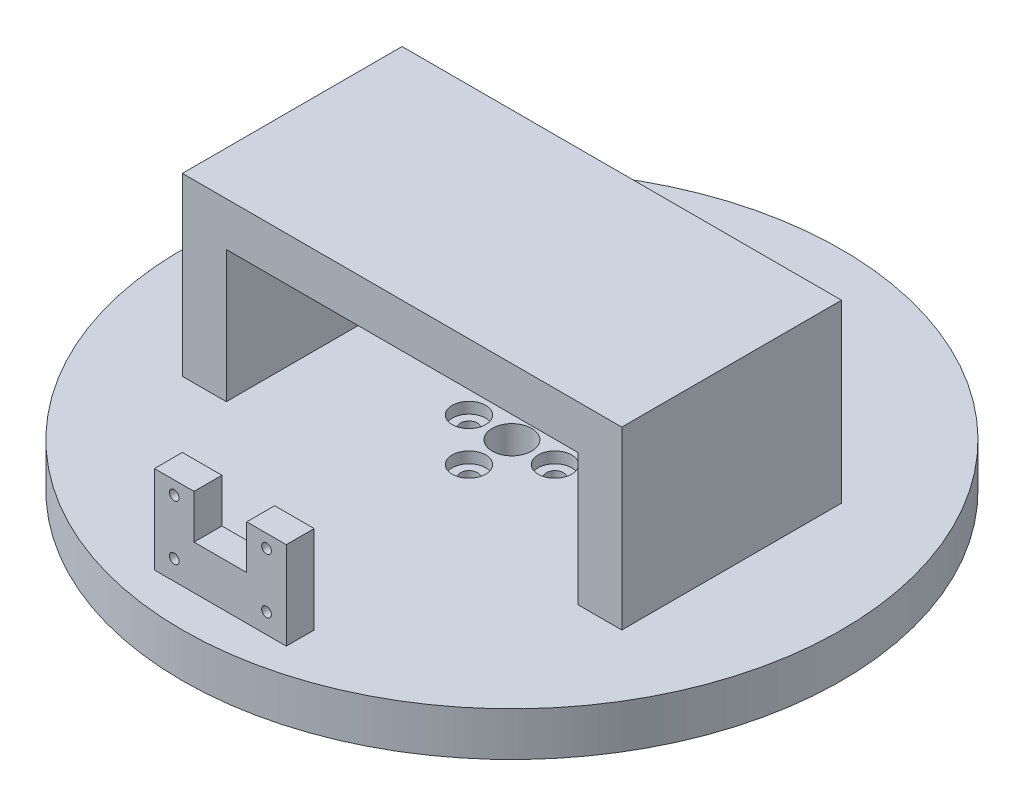
ISO-10303-21;
HEADER;
FILE_DESCRIPTION(('STEP AP214'),'2;1');
FILE_NAME('part.step','',(''),(''),'','','');
FILE_SCHEMA(('AUTOMOTIVE_DESIGN { 1 0 10303 214 1 1 1 1 }'));
ENDSEC;
DATA;
#1=APPLICATION_CONTEXT('core data for automotive mechanical design processes');
#2=APPLICATION_PROTOCOL_DEFINITION('international standard','automotive_design',2000,#1);
#3=PRODUCT_CONTEXT('',#1,'mechanical');
#4=PRODUCT('Part','Part','',(#3));
#5=PRODUCT_RELATED_PRODUCT_CATEGORY('part','',(#4));
#6=PRODUCT_DEFINITION_FORMATION('','',#4);
#7=PRODUCT_DEFINITION_CONTEXT('part definition',#1,'design');
#8=PRODUCT_DEFINITION('design','',#6,#7);
#9=PRODUCT_DEFINITION_SHAPE('','',#8);
#10=(LENGTH_UNIT() NAMED_UNIT(*) SI_UNIT(.MILLI.,.METRE.));
#11=(NAMED_UNIT(*) PLANE_ANGLE_UNIT() SI_UNIT($,.RADIAN.));
#12=(NAMED_UNIT(*) SI_UNIT($,.STERADIAN.) SOLID_ANGLE_UNIT());
#13=UNCERTAINTY_MEASURE_WITH_UNIT(LENGTH_MEASURE(1.E-05),#10,'distance_accuracy_value','');
#14=(GEOMETRIC_REPRESENTATION_CONTEXT(3) GLOBAL_UNCERTAINTY_ASSIGNED_CONTEXT((#13)) GLOBAL_UNIT_ASSIGNED_CONTEXT((#10,
#11,#12)) REPRESENTATION_CONTEXT('',''));
#15=CARTESIAN_POINT('',(0.,0.,0.));
#16=DIRECTION('',(0.,0.,1.));
#17=DIRECTION('',(1.,0.,0.));
#18=AXIS2_PLACEMENT_3D('',#15,#16,#17);
#19=CARTESIAN_POINT('',(0.,30.,0.));
#20=DIRECTION('',(0.,1.,0.));
#21=DIRECTION('',(0.,0.,1.));
#22=AXIS2_PLACEMENT_3D('',#19,#20,#21);
#23=PLANE('',#22);
#24=DIRECTION('',(0.,0.,-1.));
#25=VECTOR('',#24,1.);
#26=CARTESIAN_POINT('',(-6.,30.,-75.001));
#27=LINE('',#26,#25);
#28=CARTESIAN_POINT('',(-6.,30.,66.35));
#29=VERTEX_POINT('',#28);
#30=CARTESIAN_POINT('',(-6.,30.,60.));
#31=VERTEX_POINT('',#30);
#32=EDGE_CURVE('E164',#29,#31,#27,.T.);
#33=ORIENTED_EDGE('',*,*,#32,.T.);
#34=DIRECTION('',(-1.,0.,0.));
#35=VECTOR('',#34,1.);
#36=CARTESIAN_POINT('',(15.,30.,60.));
#37=LINE('',#36,#35);
#38=CARTESIAN_POINT('',(-15.,30.,60.));
#39=VERTEX_POINT('',#38);
#40=EDGE_CURVE('E182',#31,#39,#37,.T.);
#41=ORIENTED_EDGE('',*,*,#40,.T.);
#42=DIRECTION('',(0.,0.,1.));
#43=VECTOR('',#42,1.);
#44=CARTESIAN_POINT('',(-15.,30.,66.35));
#45=LINE('',#44,#43);
#46=CARTESIAN_POINT('',(-15.,30.,66.35));
#47=VERTEX_POINT('',#46);
#48=EDGE_CURVE('E204',#39,#47,#45,.T.);
#49=ORIENTED_EDGE('',*,*,#48,.T.);
#50=DIRECTION('',(1.,0.,0.));
#51=VECTOR('',#50,1.);
#52=CARTESIAN_POINT('',(15.,30.,66.35));
#53=LINE('',#52,#51);
#54=EDGE_CURVE('E537',#47,#29,#53,.T.);
#55=ORIENTED_EDGE('',*,*,#54,.T.);
#56=EDGE_LOOP('',(#33,#41,#49,#55));
#57=FACE_BOUND('',#56,.T.);
#58=ADVANCED_FACE('F41',(#57),#23,.T.);
#59=CARTESIAN_POINT('',(0.,10.,0.));
#60=DIRECTION('',(0.,1.,0.));
#61=DIRECTION('',(0.,0.,1.));
#62=AXIS2_PLACEMENT_3D('',#59,#60,#61);
#63=PLANE('',#62);
#64=DIRECTION('',(0.,0.,1.));
#65=VECTOR('',#64,1.);
#66=CARTESIAN_POINT('',(50.,10.,25.));
#67=LINE('',#66,#65);
#68=CARTESIAN_POINT('',(50.,10.,-25.));
#69=VERTEX_POINT('',#68);
#70=CARTESIAN_POINT('',(50.,10.,25.));
#71=VERTEX_POINT('',#70);
#72=EDGE_CURVE('E219',#69,#71,#67,.T.);
#73=ORIENTED_EDGE('',*,*,#72,.T.);
#74=DIRECTION('',(-1.,0.,0.));
#75=VECTOR('',#74,1.);
#76=CARTESIAN_POINT('',(40.,10.,25.));
#77=LINE('',#76,#75);
#78=CARTESIAN_POINT('',(40.,10.,25.));
#79=VERTEX_POINT('',#78);
#80=EDGE_CURVE('E225',#71,#79,#77,.T.);
#81=ORIENTED_EDGE('',*,*,#80,.T.);
#82=DIRECTION('',(0.,0.,-1.));
#83=VECTOR('',#82,1.);
#84=CARTESIAN_POINT('',(40.,10.,25.));
#85=LINE('',#84,#83);
#86=CARTESIAN_POINT('',(40.,10.,-25.));
#87=VERTEX_POINT('',#86);
#88=EDGE_CURVE('E231',#79,#87,#85,.T.);
#89=ORIENTED_EDGE('',*,*,#88,.T.);
#90=DIRECTION('',(1.,0.,0.));
#91=VECTOR('',#90,1.);
#92=CARTESIAN_POINT('',(40.,10.,-25.));
#93=LINE('',#92,#91);
#94=EDGE_CURVE('E228',#87,#69,#93,.T.);
#95=ORIENTED_EDGE('',*,*,#94,.T.);
#96=EDGE_LOOP('',(#73,#81,#89,#95));
#97=FACE_BOUND('',#96,.T.);
#98=CARTESIAN_POINT('',(9.779,10.,0.));
#99=DIRECTION('',(0.,1.,0.));
#100=DIRECTION('',(-1.,0.,0.));
#101=AXIS2_PLACEMENT_3D('',#98,#99,#100);
#102=CIRCLE('',#101,3.81);
#103=CARTESIAN_POINT('',(5.969,10.,0.));
#104=VERTEX_POINT('',#103);
#105=EDGE_CURVE('E305',#104,#104,#102,.T.);
#106=ORIENTED_EDGE('',*,*,#105,.F.);
#107=EDGE_LOOP('',(#106));
#108=FACE_BOUND('',#107,.T.);
#109=CARTESIAN_POINT('',(0.,10.,9.779));
#110=DIRECTION('',(0.,1.,0.));
#111=DIRECTION('',(0.,0.,-1.));
#112=AXIS2_PLACEMENT_3D('',#109,#110,#111);
#113=CIRCLE('',#112,3.81);
#114=CARTESIAN_POINT('',(0.,10.,5.969));
#115=VERTEX_POINT('',#114);
#116=EDGE_CURVE('E313',#115,#115,#113,.T.);
#117=ORIENTED_EDGE('',*,*,#116,.F.);
#118=EDGE_LOOP('',(#117));
#119=FACE_BOUND('',#118,.T.);
#120=CARTESIAN_POINT('',(-9.779,10.,-1.02429588037641E-13));
#121=DIRECTION('',(0.,1.,0.));
#122=DIRECTION('',(1.,0.,0.));
#123=AXIS2_PLACEMENT_3D('',#120,#121,#122);
#124=CIRCLE('',#123,3.81);
#125=CARTESIAN_POINT('',(-5.969,10.,0.));
#126=VERTEX_POINT('',#125);
#127=EDGE_CURVE('E299',#126,#126,#124,.T.);
#128=ORIENTED_EDGE('',*,*,#127,.F.);
#129=EDGE_LOOP('',(#128));
#130=FACE_BOUND('',#129,.T.);
#131=CARTESIAN_POINT('',(0.,10.,-9.779));
#132=DIRECTION('',(0.,1.,0.));
#133=DIRECTION('',(0.,0.,1.));
#134=AXIS2_PLACEMENT_3D('',#131,#132,#133);
#135=CIRCLE('',#134,3.81);
#136=CARTESIAN_POINT('',(0.,10.,-5.969));
#137=VERTEX_POINT('',#136);
#138=EDGE_CURVE('E329',#137,#137,#135,.T.);
#139=ORIENTED_EDGE('',*,*,#138,.F.);
#140=EDGE_LOOP('',(#139));
#141=FACE_BOUND('',#140,.T.);
#142=CARTESIAN_POINT('',(0.,10.,0.));
#143=DIRECTION('',(0.,1.,0.));
#144=DIRECTION('',(0.,0.,1.));
#145=AXIS2_PLACEMENT_3D('',#142,#143,#144);
#146=CIRCLE('',#145,4.5);
#147=CARTESIAN_POINT('',(0.,10.,4.5));
#148=VERTEX_POINT('',#147);
#149=EDGE_CURVE('E338',#148,#148,#146,.T.);
#150=ORIENTED_EDGE('',*,*,#149,.F.);
#151=EDGE_LOOP('',(#150));
#152=FACE_BOUND('',#151,.T.);
#153=CARTESIAN_POINT('',(0.,10.,0.));
#154=DIRECTION('',(0.,1.,0.));
#155=DIRECTION('',(0.,0.,1.));
#156=AXIS2_PLACEMENT_3D('',#153,#154,#155);
#157=CIRCLE('',#156,75.);
#158=CARTESIAN_POINT('',(0.,10.,75.));
#159=VERTEX_POINT('',#158);
#160=EDGE_CURVE('E11',#159,#159,#157,.T.);
#161=ORIENTED_EDGE('',*,*,#160,.T.);
#162=EDGE_LOOP('',(#161));
#163=FACE_BOUND('',#162,.T.);
#164=DIRECTION('',(1.,0.,0.));
#165=VECTOR('',#164,1.);
#166=CARTESIAN_POINT('',(-40.,10.,25.));
#167=LINE('',#166,#165);
#168=CARTESIAN_POINT('',(-50.,10.,25.));
#169=VERTEX_POINT('',#168);
#170=CARTESIAN_POINT('',(-40.,10.,25.));
#171=VERTEX_POINT('',#170);
#172=EDGE_CURVE('E277',#169,#171,#167,.T.);
#173=ORIENTED_EDGE('',*,*,#172,.F.);
#174=DIRECTION('',(0.,0.,1.));
#175=VECTOR('',#174,1.);
#176=CARTESIAN_POINT('',(-50.,10.,25.));
#177=LINE('',#176,#175);
#178=CARTESIAN_POINT('',(-50.,10.,-25.));
#179=VERTEX_POINT('',#178);
#180=EDGE_CURVE('E261',#179,#169,#177,.T.);
#181=ORIENTED_EDGE('',*,*,#180,.F.);
#182=DIRECTION('',(-1.,0.,0.));
#183=VECTOR('',#182,1.);
#184=CARTESIAN_POINT('',(-40.,10.,-25.));
#185=LINE('',#184,#183);
#186=CARTESIAN_POINT('',(-40.,10.,-25.));
#187=VERTEX_POINT('',#186);
#188=EDGE_CURVE('E267',#187,#179,#185,.T.);
#189=ORIENTED_EDGE('',*,*,#188,.F.);
#190=DIRECTION('',(0.,0.,-1.));
#191=VECTOR('',#190,1.);
#192=CARTESIAN_POINT('',(-40.,10.,25.));
#193=LINE('',#192,#191);
#194=EDGE_CURVE('E281',#171,#187,#193,.T.);
#195=ORIENTED_EDGE('',*,*,#194,.F.);
#196=EDGE_LOOP('',(#173,#181,#189,#195));
#197=FACE_BOUND('',#196,.T.);
#198=DIRECTION('',(1.,0.,0.));
#199=VECTOR('',#198,1.);
#200=CARTESIAN_POINT('',(15.,10.,66.35));
#201=LINE('',#200,#199);
#202=CARTESIAN_POINT('',(-15.,10.,66.35));
#203=VERTEX_POINT('',#202);
#204=CARTESIAN_POINT('',(15.,10.,66.35));
#205=VERTEX_POINT('',#204);
#206=EDGE_CURVE('E195',#203,#205,#201,.T.);
#207=ORIENTED_EDGE('',*,*,#206,.F.);
#208=DIRECTION('',(0.,0.,1.));
#209=VECTOR('',#208,1.);
#210=CARTESIAN_POINT('',(-15.,10.,66.35));
#211=LINE('',#210,#209);
#212=CARTESIAN_POINT('',(-15.,10.,60.));
#213=VERTEX_POINT('',#212);
#214=EDGE_CURVE('E191',#213,#203,#211,.T.);
#215=ORIENTED_EDGE('',*,*,#214,.F.);
#216=DIRECTION('',(-1.,0.,0.));
#217=VECTOR('',#216,1.);
#218=CARTESIAN_POINT('',(15.,10.,60.));
#219=LINE('',#218,#217);
#220=CARTESIAN_POINT('',(15.,10.,60.));
#221=VERTEX_POINT('',#220);
#222=EDGE_CURVE('E202',#221,#213,#219,.T.);
#223=ORIENTED_EDGE('',*,*,#222,.F.);
#224=DIRECTION('',(0.,0.,-1.));
#225=VECTOR('',#224,1.);
#226=CARTESIAN_POINT('',(15.,10.,66.35));
#227=LINE('',#226,#225);
#228=EDGE_CURVE('E199',#205,#221,#227,.T.);
#229=ORIENTED_EDGE('',*,*,#228,.F.);
#230=EDGE_LOOP('',(#207,#215,#223,#229));
#231=FACE_BOUND('',#230,.T.);
#232=ADVANCED_FACE('F389',(#97,#108,#119,#130,#141,#152,#163,#197,#231),#63,.T.);
#233=CARTESIAN_POINT('',(-40.,50.,25.));
#234=DIRECTION('',(-1.,0.,0.));
#235=DIRECTION('',(0.,0.,1.));
#236=AXIS2_PLACEMENT_3D('',#233,#234,#235);
#237=PLANE('',#236);
#238=DIRECTION('',(0.,0.,-1.));
#239=VECTOR('',#238,1.);
#240=CARTESIAN_POINT('',(-40.,40.,25.));
#241=LINE('',#240,#239);
#242=CARTESIAN_POINT('',(-40.,40.,25.));
#243=VERTEX_POINT('',#242);
#244=CARTESIAN_POINT('',(-40.,40.,-25.));
#245=VERTEX_POINT('',#244);
#246=EDGE_CURVE('E251',#243,#245,#241,.T.);
#247=ORIENTED_EDGE('',*,*,#246,.F.);
#248=DIRECTION('',(0.,-1.,0.));
#249=VECTOR('',#248,1.);
#250=CARTESIAN_POINT('',(-40.,50.,25.));
#251=LINE('',#250,#249);
#252=EDGE_CURVE('E293',#243,#171,#251,.T.);
#253=ORIENTED_EDGE('',*,*,#252,.T.);
#254=ORIENTED_EDGE('',*,*,#194,.T.);
#255=DIRECTION('',(0.,-1.,0.));
#256=VECTOR('',#255,1.);
#257=CARTESIAN_POINT('',(-40.,50.,-25.));
#258=LINE('',#257,#256);
#259=EDGE_CURVE('E290',#245,#187,#258,.T.);
#260=ORIENTED_EDGE('',*,*,#259,.F.);
#261=EDGE_LOOP('',(#247,#253,#254,#260));
#262=FACE_BOUND('',#261,.T.);
#263=ADVANCED_FACE('F379',(#262),#237,.F.);
#264=CARTESIAN_POINT('',(-9.779,0.,-1.02429588037641E-13));
#265=DIRECTION('',(0.,1.,0.));
#266=DIRECTION('',(0.,0.,1.));
#267=AXIS2_PLACEMENT_3D('',#264,#265,#266);
#268=CYLINDRICAL_SURFACE('',#267,1.905);
#269=CARTESIAN_POINT('',(-9.779,0.,-1.02429588037641E-13));
#270=DIRECTION('',(0.,1.,0.));
#271=DIRECTION('',(1.,0.,0.));
#272=AXIS2_PLACEMENT_3D('',#269,#270,#271);
#273=CIRCLE('',#272,1.905);
#274=CARTESIAN_POINT('',(-7.874,0.,0.));
#275=VERTEX_POINT('',#274);
#276=EDGE_CURVE('E337',#275,#275,#273,.T.);
#277=ORIENTED_EDGE('',*,*,#276,.F.);
#278=EDGE_LOOP('',(#277));
#279=FACE_BOUND('',#278,.T.);
#280=CARTESIAN_POINT('',(-9.779,7.46,-1.02429588037641E-13));
#281=DIRECTION('',(0.,1.,0.));
#282=DIRECTION('',(0.,0.,1.));
#283=AXIS2_PLACEMENT_3D('',#280,#281,#282);
#284=CIRCLE('',#283,1.905);
#285=CARTESIAN_POINT('',(-9.779,7.46,1.9049999999999));
#286=VERTEX_POINT('',#285);
#287=EDGE_CURVE('E45',#286,#286,#284,.F.);
#288=ORIENTED_EDGE('',*,*,#287,.F.);
#289=EDGE_LOOP('',(#288));
#290=FACE_BOUND('',#289,.T.);
#291=ADVANCED_FACE('F376',(#279,#290),#268,.F.);
#292=CARTESIAN_POINT('',(0.,0.,9.779));
#293=DIRECTION('',(0.,1.,0.));
#294=DIRECTION('',(0.,0.,1.));
#295=AXIS2_PLACEMENT_3D('',#292,#293,#294);
#296=CYLINDRICAL_SURFACE('',#295,1.905);
#297=CARTESIAN_POINT('',(0.,0.,9.779));
#298=DIRECTION('',(0.,1.,0.));
#299=DIRECTION('',(0.,0.,-1.));
#300=AXIS2_PLACEMENT_3D('',#297,#298,#299);
#301=CIRCLE('',#300,1.905);
#302=CARTESIAN_POINT('',(0.,0.,7.874));
#303=VERTEX_POINT('',#302);
#304=EDGE_CURVE('E347',#303,#303,#301,.T.);
#305=ORIENTED_EDGE('',*,*,#304,.F.);
#306=EDGE_LOOP('',(#305));
#307=FACE_BOUND('',#306,.T.);
#308=CARTESIAN_POINT('',(0.,7.46,9.779));
#309=DIRECTION('',(0.,1.,0.));
#310=DIRECTION('',(0.,0.,1.));
#311=AXIS2_PLACEMENT_3D('',#308,#309,#310);
#312=CIRCLE('',#311,1.905);
#313=CARTESIAN_POINT('',(0.,7.46,11.684));
#314=VERTEX_POINT('',#313);
#315=EDGE_CURVE('E365',#314,#314,#312,.F.);
#316=ORIENTED_EDGE('',*,*,#315,.F.);
#317=EDGE_LOOP('',(#316));
#318=FACE_BOUND('',#317,.T.);
#319=ADVANCED_FACE('F378',(#307,#318),#296,.F.);
#320=CARTESIAN_POINT('',(9.779,0.,0.));
#321=DIRECTION('',(0.,1.,0.));
#322=DIRECTION('',(0.,0.,1.));
#323=AXIS2_PLACEMENT_3D('',#320,#321,#322);
#324=CYLINDRICAL_SURFACE('',#323,1.905);
#325=CARTESIAN_POINT('',(9.779,0.,0.));
#326=DIRECTION('',(0.,1.,0.));
#327=DIRECTION('',(-1.,0.,0.));
#328=AXIS2_PLACEMENT_3D('',#325,#326,#327);
#329=CIRCLE('',#328,1.905);
#330=CARTESIAN_POINT('',(7.874,0.,0.));
#331=VERTEX_POINT('',#330);
#332=EDGE_CURVE('E342',#331,#331,#329,.T.);
#333=ORIENTED_EDGE('',*,*,#332,.F.);
#334=EDGE_LOOP('',(#333));
#335=FACE_BOUND('',#334,.T.);
#336=CARTESIAN_POINT('',(9.779,7.46,0.));
#337=DIRECTION('',(0.,1.,0.));
#338=DIRECTION('',(0.,0.,1.));
#339=AXIS2_PLACEMENT_3D('',#336,#337,#338);
#340=CIRCLE('',#339,1.905);
#341=CARTESIAN_POINT('',(9.779,7.46,1.90500000000003));
#342=VERTEX_POINT('',#341);
#343=EDGE_CURVE('E304',#342,#342,#340,.F.);
#344=ORIENTED_EDGE('',*,*,#343,.F.);
#345=EDGE_LOOP('',(#344));
#346=FACE_BOUND('',#345,.T.);
#347=ADVANCED_FACE('F386',(#335,#346),#324,.F.);
#348=CARTESIAN_POINT('',(0.,0.,-9.779));
#349=DIRECTION('',(0.,1.,0.));
#350=DIRECTION('',(0.,0.,1.));
#351=AXIS2_PLACEMENT_3D('',#348,#349,#350);
#352=CYLINDRICAL_SURFACE('',#351,1.905);
#353=CARTESIAN_POINT('',(0.,0.,-9.779));
#354=DIRECTION('',(0.,1.,0.));
#355=DIRECTION('',(0.,0.,1.));
#356=AXIS2_PLACEMENT_3D('',#353,#354,#355);
#357=CIRCLE('',#356,1.905);
#358=CARTESIAN_POINT('',(0.,0.,-7.874));
#359=VERTEX_POINT('',#358);
#360=EDGE_CURVE('E346',#359,#359,#357,.T.);
#361=ORIENTED_EDGE('',*,*,#360,.F.);
#362=EDGE_LOOP('',(#361));
#363=FACE_BOUND('',#362,.T.);
#364=CARTESIAN_POINT('',(0.,7.46,-9.779));
#365=DIRECTION('',(0.,1.,0.));
#366=DIRECTION('',(0.,0.,1.));
#367=AXIS2_PLACEMENT_3D('',#364,#365,#366);
#368=CIRCLE('',#367,1.905);
#369=CARTESIAN_POINT('',(0.,7.46,-7.874));
#370=VERTEX_POINT('',#369);
#371=EDGE_CURVE('E328',#370,#370,#368,.F.);
#372=ORIENTED_EDGE('',*,*,#371,.F.);
#373=EDGE_LOOP('',(#372));
#374=FACE_BOUND('',#373,.T.);
#375=ADVANCED_FACE('F496',(#363,#374),#352,.F.);
#376=CARTESIAN_POINT('',(0.,10.,0.));
#377=DIRECTION('',(0.,-1.,0.));
#378=DIRECTION('',(0.,0.,-1.));
#379=AXIS2_PLACEMENT_3D('',#376,#377,#378);
#380=CYLINDRICAL_SURFACE('',#379,75.);
#381=ORIENTED_EDGE('',*,*,#160,.F.);
#382=EDGE_LOOP('',(#381));
#383=FACE_BOUND('',#382,.T.);
#384=CARTESIAN_POINT('',(0.,0.,0.));
#385=DIRECTION('',(0.,1.,0.));
#386=DIRECTION('',(0.,0.,1.));
#387=AXIS2_PLACEMENT_3D('',#384,#385,#386);
#388=CIRCLE('',#387,75.);
#389=CARTESIAN_POINT('',(0.,0.,75.));
#390=VERTEX_POINT('',#389);
#391=EDGE_CURVE('E51',#390,#390,#388,.T.);
#392=ORIENTED_EDGE('',*,*,#391,.T.);
#393=EDGE_LOOP('',(#392));
#394=FACE_BOUND('',#393,.T.);
#395=ADVANCED_FACE('F43',(#383,#394),#380,.T.);
#396=CARTESIAN_POINT('',(0.,0.,0.));
#397=DIRECTION('',(0.,1.,0.));
#398=DIRECTION('',(0.,0.,1.));
#399=AXIS2_PLACEMENT_3D('',#396,#397,#398);
#400=PLANE('',#399);
#401=CARTESIAN_POINT('',(0.,0.,0.));
#402=DIRECTION('',(0.,1.,0.));
#403=DIRECTION('',(0.,0.,1.));
#404=AXIS2_PLACEMENT_3D('',#401,#402,#403);
#405=CIRCLE('',#404,4.5);
#406=CARTESIAN_POINT('',(0.,0.,4.5));
#407=VERTEX_POINT('',#406);
#408=EDGE_CURVE('E333',#407,#407,#405,.T.);
#409=ORIENTED_EDGE('',*,*,#408,.T.);
#410=EDGE_LOOP('',(#409));
#411=FACE_BOUND('',#410,.T.);
#412=ORIENTED_EDGE('',*,*,#332,.T.);
#413=EDGE_LOOP('',(#412));
#414=FACE_BOUND('',#413,.T.);
#415=ORIENTED_EDGE('',*,*,#304,.T.);
#416=EDGE_LOOP('',(#415));
#417=FACE_BOUND('',#416,.T.);
#418=ORIENTED_EDGE('',*,*,#276,.T.);
#419=EDGE_LOOP('',(#418));
#420=FACE_BOUND('',#419,.T.);
#421=ORIENTED_EDGE('',*,*,#360,.T.);
#422=EDGE_LOOP('',(#421));
#423=FACE_BOUND('',#422,.T.);
#424=ORIENTED_EDGE('',*,*,#391,.F.);
#425=EDGE_LOOP('',(#424));
#426=FACE_BOUND('',#425,.T.);
#427=ADVANCED_FACE('F493',(#411,#414,#417,#420,#423,#426),#400,.F.);
#428=CARTESIAN_POINT('',(0.,0.,0.));
#429=DIRECTION('',(0.,1.,0.));
#430=DIRECTION('',(0.,0.,1.));
#431=AXIS2_PLACEMENT_3D('',#428,#429,#430);
#432=CYLINDRICAL_SURFACE('',#431,4.5);
#433=ORIENTED_EDGE('',*,*,#408,.F.);
#434=EDGE_LOOP('',(#433));
#435=FACE_BOUND('',#434,.T.);
#436=ORIENTED_EDGE('',*,*,#149,.T.);
#437=EDGE_LOOP('',(#436));
#438=FACE_BOUND('',#437,.T.);
#439=ADVANCED_FACE('F486',(#435,#438),#432,.F.);
#440=CARTESIAN_POINT('',(0.,7.46,-9.779));
#441=DIRECTION('',(0.,1.,0.));
#442=DIRECTION('',(0.,0.,1.));
#443=AXIS2_PLACEMENT_3D('',#440,#441,#442);
#444=PLANE('',#443);
#445=CARTESIAN_POINT('',(0.,7.46,-9.779));
#446=DIRECTION('',(0.,1.,0.));
#447=DIRECTION('',(0.,0.,1.));
#448=AXIS2_PLACEMENT_3D('',#445,#446,#447);
#449=CIRCLE('',#448,3.81);
#450=CARTESIAN_POINT('',(0.,7.46,-5.969));
#451=VERTEX_POINT('',#450);
#452=EDGE_CURVE('E324',#451,#451,#449,.T.);
#453=ORIENTED_EDGE('',*,*,#452,.T.);
#454=EDGE_LOOP('',(#453));
#455=FACE_BOUND('',#454,.T.);
#456=ORIENTED_EDGE('',*,*,#371,.T.);
#457=EDGE_LOOP('',(#456));
#458=FACE_BOUND('',#457,.T.);
#459=ADVANCED_FACE('F483',(#455,#458),#444,.T.);
#460=CARTESIAN_POINT('',(0.,7.46,-9.779));
#461=DIRECTION('',(0.,1.,0.));
#462=DIRECTION('',(0.,0.,1.));
#463=AXIS2_PLACEMENT_3D('',#460,#461,#462);
#464=CYLINDRICAL_SURFACE('',#463,3.81);
#465=ORIENTED_EDGE('',*,*,#452,.F.);
#466=EDGE_LOOP('',(#465));
#467=FACE_BOUND('',#466,.T.);
#468=ORIENTED_EDGE('',*,*,#138,.T.);
#469=EDGE_LOOP('',(#468));
#470=FACE_BOUND('',#469,.T.);
#471=ADVANCED_FACE('F464',(#467,#470),#464,.F.);
#472=CARTESIAN_POINT('',(9.779,7.46,0.));
#473=DIRECTION('',(0.,1.,0.));
#474=DIRECTION('',(-1.,0.,0.));
#475=AXIS2_PLACEMENT_3D('',#472,#473,#474);
#476=PLANE('',#475);
#477=CARTESIAN_POINT('',(9.779,7.46,0.));
#478=DIRECTION('',(0.,1.,0.));
#479=DIRECTION('',(-1.,0.,0.));
#480=AXIS2_PLACEMENT_3D('',#477,#478,#479);
#481=CIRCLE('',#480,3.81);
#482=CARTESIAN_POINT('',(5.969,7.46,0.));
#483=VERTEX_POINT('',#482);
#484=EDGE_CURVE('E300',#483,#483,#481,.T.);
#485=ORIENTED_EDGE('',*,*,#484,.T.);
#486=EDGE_LOOP('',(#485));
#487=FACE_BOUND('',#486,.T.);
#488=ORIENTED_EDGE('',*,*,#343,.T.);
#489=EDGE_LOOP('',(#488));
#490=FACE_BOUND('',#489,.T.);
#491=ADVANCED_FACE('F460',(#487,#490),#476,.T.);
#492=CARTESIAN_POINT('',(9.779,7.46,0.));
#493=DIRECTION('',(0.,1.,0.));
#494=DIRECTION('',(0.,0.,1.));
#495=AXIS2_PLACEMENT_3D('',#492,#493,#494);
#496=CYLINDRICAL_SURFACE('',#495,3.81);
#497=ORIENTED_EDGE('',*,*,#484,.F.);
#498=EDGE_LOOP('',(#497));
#499=FACE_BOUND('',#498,.T.);
#500=ORIENTED_EDGE('',*,*,#105,.T.);
#501=EDGE_LOOP('',(#500));
#502=FACE_BOUND('',#501,.T.);
#503=ADVANCED_FACE('F463',(#499,#502),#496,.F.);
#504=CARTESIAN_POINT('',(0.,7.46,9.779));
#505=DIRECTION('',(0.,1.,0.));
#506=DIRECTION('',(0.,0.,-1.));
#507=AXIS2_PLACEMENT_3D('',#504,#505,#506);
#508=PLANE('',#507);
#509=CARTESIAN_POINT('',(0.,7.46,9.779));
#510=DIRECTION('',(0.,1.,0.));
#511=DIRECTION('',(0.,0.,-1.));
#512=AXIS2_PLACEMENT_3D('',#509,#510,#511);
#513=CIRCLE('',#512,3.81);
#514=CARTESIAN_POINT('',(0.,7.46,5.969));
#515=VERTEX_POINT('',#514);
#516=EDGE_CURVE('E309',#515,#515,#513,.T.);
#517=ORIENTED_EDGE('',*,*,#516,.T.);
#518=EDGE_LOOP('',(#517));
#519=FACE_BOUND('',#518,.T.);
#520=ORIENTED_EDGE('',*,*,#315,.T.);
#521=EDGE_LOOP('',(#520));
#522=FACE_BOUND('',#521,.T.);
#523=ADVANCED_FACE('F468',(#519,#522),#508,.T.);
#524=CARTESIAN_POINT('',(0.,7.46,9.779));
#525=DIRECTION('',(0.,1.,0.));
#526=DIRECTION('',(0.,0.,1.));
#527=AXIS2_PLACEMENT_3D('',#524,#525,#526);
#528=CYLINDRICAL_SURFACE('',#527,3.81);
#529=ORIENTED_EDGE('',*,*,#516,.F.);
#530=EDGE_LOOP('',(#529));
#531=FACE_BOUND('',#530,.T.);
#532=ORIENTED_EDGE('',*,*,#116,.T.);
#533=EDGE_LOOP('',(#532));
#534=FACE_BOUND('',#533,.T.);
#535=ADVANCED_FACE('F472',(#531,#534),#528,.F.);
#536=CARTESIAN_POINT('',(-9.779,7.46,-1.02429588037641E-13));
#537=DIRECTION('',(0.,1.,0.));
#538=DIRECTION('',(1.,0.,0.));
#539=AXIS2_PLACEMENT_3D('',#536,#537,#538);
#540=PLANE('',#539);
#541=CARTESIAN_POINT('',(-9.779,7.46,-1.02429588037641E-13));
#542=DIRECTION('',(0.,1.,0.));
#543=DIRECTION('',(1.,0.,0.));
#544=AXIS2_PLACEMENT_3D('',#541,#542,#543);
#545=CIRCLE('',#544,3.81);
#546=CARTESIAN_POINT('',(-5.969,7.46,0.));
#547=VERTEX_POINT('',#546);
#548=EDGE_CURVE('E317',#547,#547,#545,.T.);
#549=ORIENTED_EDGE('',*,*,#548,.T.);
#550=EDGE_LOOP('',(#549));
#551=FACE_BOUND('',#550,.T.);
#552=ORIENTED_EDGE('',*,*,#287,.T.);
#553=EDGE_LOOP('',(#552));
#554=FACE_BOUND('',#553,.T.);
#555=ADVANCED_FACE('F374',(#551,#554),#540,.T.);
#556=CARTESIAN_POINT('',(-9.779,7.46,-1.02429588037641E-13));
#557=DIRECTION('',(0.,1.,0.));
#558=DIRECTION('',(0.,0.,1.));
#559=AXIS2_PLACEMENT_3D('',#556,#557,#558);
#560=CYLINDRICAL_SURFACE('',#559,3.81);
#561=ORIENTED_EDGE('',*,*,#548,.F.);
#562=EDGE_LOOP('',(#561));
#563=FACE_BOUND('',#562,.T.);
#564=ORIENTED_EDGE('',*,*,#127,.T.);
#565=EDGE_LOOP('',(#564));
#566=FACE_BOUND('',#565,.T.);
#567=ADVANCED_FACE('F458',(#563,#566),#560,.F.);
#568=CARTESIAN_POINT('',(-50.,50.,25.));
#569=DIRECTION('',(1.,0.,0.));
#570=DIRECTION('',(0.,0.,-1.));
#571=AXIS2_PLACEMENT_3D('',#568,#569,#570);
#572=PLANE('',#571);
#573=ORIENTED_EDGE('',*,*,#180,.T.);
#574=DIRECTION('',(0.,-1.,0.));
#575=VECTOR('',#574,1.);
#576=CARTESIAN_POINT('',(-50.,50.,25.));
#577=LINE('',#576,#575);
#578=CARTESIAN_POINT('',(-50.,50.,25.));
#579=VERTEX_POINT('',#578);
#580=EDGE_CURVE('E296',#579,#169,#577,.T.);
#581=ORIENTED_EDGE('',*,*,#580,.F.);
#582=DIRECTION('',(0.,0.,1.));
#583=VECTOR('',#582,1.);
#584=CARTESIAN_POINT('',(-50.,50.,25.));
#585=LINE('',#584,#583);
#586=CARTESIAN_POINT('',(-50.,50.,-25.));
#587=VERTEX_POINT('',#586);
#588=EDGE_CURVE('E262',#587,#579,#585,.T.);
#589=ORIENTED_EDGE('',*,*,#588,.F.);
#590=DIRECTION('',(0.,-1.,0.));
#591=VECTOR('',#590,1.);
#592=CARTESIAN_POINT('',(-50.,50.,-25.));
#593=LINE('',#592,#591);
#594=EDGE_CURVE('E273',#587,#179,#593,.T.);
#595=ORIENTED_EDGE('',*,*,#594,.T.);
#596=EDGE_LOOP('',(#573,#581,#589,#595));
#597=FACE_BOUND('',#596,.T.);
#598=ADVANCED_FACE('F454',(#597),#572,.F.);
#599=CARTESIAN_POINT('',(-40.,50.,25.));
#600=DIRECTION('',(0.,0.,-1.));
#601=DIRECTION('',(-1.,0.,0.));
#602=AXIS2_PLACEMENT_3D('',#599,#600,#601);
#603=PLANE('',#602);
#604=ORIENTED_EDGE('',*,*,#172,.T.);
#605=ORIENTED_EDGE('',*,*,#252,.F.);
#606=DIRECTION('',(-1.,0.,0.));
#607=VECTOR('',#606,1.);
#608=CARTESIAN_POINT('',(0.,40.,25.));
#609=LINE('',#608,#607);
#610=CARTESIAN_POINT('',(40.,40.,25.));
#611=VERTEX_POINT('',#610);
#612=EDGE_CURVE('E258',#611,#243,#609,.T.);
#613=ORIENTED_EDGE('',*,*,#612,.F.);
#614=DIRECTION('',(0.,-1.,0.));
#615=VECTOR('',#614,1.);
#616=CARTESIAN_POINT('',(40.,50.,25.));
#617=LINE('',#616,#615);
#618=EDGE_CURVE('E241',#611,#79,#617,.T.);
#619=ORIENTED_EDGE('',*,*,#618,.T.);
#620=ORIENTED_EDGE('',*,*,#80,.F.);
#621=DIRECTION('',(0.,-1.,0.));
#622=VECTOR('',#621,1.);
#623=CARTESIAN_POINT('',(50.,50.,25.));
#624=LINE('',#623,#622);
#625=CARTESIAN_POINT('',(50.,50.,25.));
#626=VERTEX_POINT('',#625);
#627=EDGE_CURVE('E224',#626,#71,#624,.T.);
#628=ORIENTED_EDGE('',*,*,#627,.F.);
#629=DIRECTION('',(1.,0.,0.));
#630=VECTOR('',#629,1.);
#631=CARTESIAN_POINT('',(-40.,50.,25.));
#632=LINE('',#631,#630);
#633=EDGE_CURVE('E266',#579,#626,#632,.T.);
#634=ORIENTED_EDGE('',*,*,#633,.F.);
#635=ORIENTED_EDGE('',*,*,#580,.T.);
#636=EDGE_LOOP('',(#604,#605,#613,#619,#620,#628,#634,#635));
#637=FACE_BOUND('',#636,.T.);
#638=ADVANCED_FACE('F449',(#637),#603,.F.);
#639=CARTESIAN_POINT('',(-40.,50.,-25.));
#640=DIRECTION('',(0.,0.,1.));
#641=DIRECTION('',(1.,0.,0.));
#642=AXIS2_PLACEMENT_3D('',#639,#640,#641);
#643=PLANE('',#642);
#644=ORIENTED_EDGE('',*,*,#188,.T.);
#645=ORIENTED_EDGE('',*,*,#594,.F.);
#646=DIRECTION('',(-1.,0.,0.));
#647=VECTOR('',#646,1.);
#648=CARTESIAN_POINT('',(-40.,50.,-25.));
#649=LINE('',#648,#647);
#650=CARTESIAN_POINT('',(50.,50.,-25.));
#651=VERTEX_POINT('',#650);
#652=EDGE_CURVE('E270',#651,#587,#649,.T.);
#653=ORIENTED_EDGE('',*,*,#652,.F.);
#654=DIRECTION('',(0.,-1.,0.));
#655=VECTOR('',#654,1.);
#656=CARTESIAN_POINT('',(50.,50.,-25.));
#657=LINE('',#656,#655);
#658=EDGE_CURVE('E247',#651,#69,#657,.T.);
#659=ORIENTED_EDGE('',*,*,#658,.T.);
#660=ORIENTED_EDGE('',*,*,#94,.F.);
#661=DIRECTION('',(0.,-1.,0.));
#662=VECTOR('',#661,1.);
#663=CARTESIAN_POINT('',(40.,50.,-25.));
#664=LINE('',#663,#662);
#665=CARTESIAN_POINT('',(40.,40.,-25.));
#666=VERTEX_POINT('',#665);
#667=EDGE_CURVE('E244',#666,#87,#664,.T.);
#668=ORIENTED_EDGE('',*,*,#667,.F.);
#669=DIRECTION('',(-1.,0.,0.));
#670=VECTOR('',#669,1.);
#671=CARTESIAN_POINT('',(0.,40.,-25.));
#672=LINE('',#671,#670);
#673=EDGE_CURVE('E254',#666,#245,#672,.T.);
#674=ORIENTED_EDGE('',*,*,#673,.T.);
#675=ORIENTED_EDGE('',*,*,#259,.T.);
#676=EDGE_LOOP('',(#644,#645,#653,#659,#660,#668,#674,#675));
#677=FACE_BOUND('',#676,.T.);
#678=ADVANCED_FACE('F446',(#677),#643,.F.);
#679=CARTESIAN_POINT('',(0.,50.,0.));
#680=DIRECTION('',(0.,1.,0.));
#681=DIRECTION('',(0.,0.,1.));
#682=AXIS2_PLACEMENT_3D('',#679,#680,#681);
#683=PLANE('',#682);
#684=ORIENTED_EDGE('',*,*,#588,.T.);
#685=ORIENTED_EDGE('',*,*,#633,.T.);
#686=DIRECTION('',(0.,0.,1.));
#687=VECTOR('',#686,1.);
#688=CARTESIAN_POINT('',(50.,50.,25.));
#689=LINE('',#688,#687);
#690=EDGE_CURVE('E220',#651,#626,#689,.T.);
#691=ORIENTED_EDGE('',*,*,#690,.F.);
#692=ORIENTED_EDGE('',*,*,#652,.T.);
#693=EDGE_LOOP('',(#684,#685,#691,#692));
#694=FACE_BOUND('',#693,.T.);
#695=ADVANCED_FACE('F442',(#694),#683,.T.);
#696=CARTESIAN_POINT('',(0.,40.,25.));
#697=DIRECTION('',(0.,1.,0.));
#698=DIRECTION('',(0.,0.,1.));
#699=AXIS2_PLACEMENT_3D('',#696,#697,#698);
#700=PLANE('',#699);
#701=ORIENTED_EDGE('',*,*,#246,.T.);
#702=ORIENTED_EDGE('',*,*,#673,.F.);
#703=DIRECTION('',(0.,0.,-1.));
#704=VECTOR('',#703,1.);
#705=CARTESIAN_POINT('',(40.,40.,25.));
#706=LINE('',#705,#704);
#707=EDGE_CURVE('E215',#611,#666,#706,.T.);
#708=ORIENTED_EDGE('',*,*,#707,.F.);
#709=ORIENTED_EDGE('',*,*,#612,.T.);
#710=EDGE_LOOP('',(#701,#702,#708,#709));
#711=FACE_BOUND('',#710,.T.);
#712=ADVANCED_FACE('F438',(#711),#700,.F.);
#713=CARTESIAN_POINT('',(50.,50.,25.));
#714=DIRECTION('',(1.,0.,0.));
#715=DIRECTION('',(0.,0.,-1.));
#716=AXIS2_PLACEMENT_3D('',#713,#714,#715);
#717=PLANE('',#716);
#718=ORIENTED_EDGE('',*,*,#72,.F.);
#719=ORIENTED_EDGE('',*,*,#658,.F.);
#720=ORIENTED_EDGE('',*,*,#690,.T.);
#721=ORIENTED_EDGE('',*,*,#627,.T.);
#722=EDGE_LOOP('',(#718,#719,#720,#721));
#723=FACE_BOUND('',#722,.T.);
#724=ADVANCED_FACE('F434',(#723),#717,.T.);
#725=CARTESIAN_POINT('',(40.,50.,25.));
#726=DIRECTION('',(-1.,0.,0.));
#727=DIRECTION('',(0.,0.,1.));
#728=AXIS2_PLACEMENT_3D('',#725,#726,#727);
#729=PLANE('',#728);
#730=ORIENTED_EDGE('',*,*,#707,.T.);
#731=ORIENTED_EDGE('',*,*,#667,.T.);
#732=ORIENTED_EDGE('',*,*,#88,.F.);
#733=ORIENTED_EDGE('',*,*,#618,.F.);
#734=EDGE_LOOP('',(#730,#731,#732,#733));
#735=FACE_BOUND('',#734,.T.);
#736=ADVANCED_FACE('F430',(#735),#729,.T.);
#737=CARTESIAN_POINT('',(-15.,30.,66.35));
#738=DIRECTION('',(1.,0.,0.));
#739=DIRECTION('',(0.,0.,-1.));
#740=AXIS2_PLACEMENT_3D('',#737,#738,#739);
#741=PLANE('',#740);
#742=ORIENTED_EDGE('',*,*,#214,.T.);
#743=DIRECTION('',(0.,-1.,0.));
#744=VECTOR('',#743,1.);
#745=CARTESIAN_POINT('',(-15.,30.,66.35));
#746=LINE('',#745,#744);
#747=EDGE_CURVE('E212',#47,#203,#746,.T.);
#748=ORIENTED_EDGE('',*,*,#747,.F.);
#749=ORIENTED_EDGE('',*,*,#48,.F.);
#750=DIRECTION('',(0.,-1.,0.));
#751=VECTOR('',#750,1.);
#752=CARTESIAN_POINT('',(-15.,30.,60.));
#753=LINE('',#752,#751);
#754=EDGE_CURVE('E181',#39,#213,#753,.T.);
#755=ORIENTED_EDGE('',*,*,#754,.T.);
#756=EDGE_LOOP('',(#742,#748,#749,#755));
#757=FACE_BOUND('',#756,.T.);
#758=ADVANCED_FACE('F426',(#757),#741,.F.);
#759=CARTESIAN_POINT('',(15.,30.,66.35));
#760=DIRECTION('',(0.,0.,-1.));
#761=DIRECTION('',(-1.,0.,0.));
#762=AXIS2_PLACEMENT_3D('',#759,#760,#761);
#763=PLANE('',#762);
#764=CARTESIAN_POINT('',(-10.5,14.5,66.35));
#765=DIRECTION('',(0.,0.,1.));
#766=DIRECTION('',(1.,0.,0.));
#767=AXIS2_PLACEMENT_3D('',#764,#765,#766);
#768=CIRCLE('',#767,1.1);
#769=CARTESIAN_POINT('',(-9.4,14.5,66.35));
#770=VERTEX_POINT('',#769);
#771=EDGE_CURVE('E558',#770,#770,#768,.T.);
#772=ORIENTED_EDGE('',*,*,#771,.F.);
#773=EDGE_LOOP('',(#772));
#774=FACE_BOUND('',#773,.T.);
#775=CARTESIAN_POINT('',(10.5,27.,66.35));
#776=DIRECTION('',(0.,0.,1.));
#777=DIRECTION('',(1.,0.,0.));
#778=AXIS2_PLACEMENT_3D('',#775,#776,#777);
#779=CIRCLE('',#778,1.1);
#780=CARTESIAN_POINT('',(11.6,27.,66.35));
#781=VERTEX_POINT('',#780);
#782=EDGE_CURVE('E559',#781,#781,#779,.T.);
#783=ORIENTED_EDGE('',*,*,#782,.F.);
#784=EDGE_LOOP('',(#783));
#785=FACE_BOUND('',#784,.T.);
#786=CARTESIAN_POINT('',(10.5,14.5,66.35));
#787=DIRECTION('',(0.,0.,1.));
#788=DIRECTION('',(1.,0.,0.));
#789=AXIS2_PLACEMENT_3D('',#786,#787,#788);
#790=CIRCLE('',#789,1.1);
#791=CARTESIAN_POINT('',(11.6,14.5,66.35));
#792=VERTEX_POINT('',#791);
#793=EDGE_CURVE('E572',#792,#792,#790,.T.);
#794=ORIENTED_EDGE('',*,*,#793,.F.);
#795=EDGE_LOOP('',(#794));
#796=FACE_BOUND('',#795,.T.);
#797=CARTESIAN_POINT('',(-10.5,27.,66.35));
#798=DIRECTION('',(0.,0.,1.));
#799=DIRECTION('',(1.,0.,0.));
#800=AXIS2_PLACEMENT_3D('',#797,#798,#799);
#801=CIRCLE('',#800,1.1);
#802=CARTESIAN_POINT('',(-9.4,27.,66.35));
#803=VERTEX_POINT('',#802);
#804=EDGE_CURVE('E549',#803,#803,#801,.T.);
#805=ORIENTED_EDGE('',*,*,#804,.F.);
#806=EDGE_LOOP('',(#805));
#807=FACE_BOUND('',#806,.T.);
#808=DIRECTION('',(1.,0.,0.));
#809=VECTOR('',#808,1.);
#810=CARTESIAN_POINT('',(6.,20.,66.35));
#811=LINE('',#810,#809);
#812=CARTESIAN_POINT('',(-6.,20.,66.35));
#813=VERTEX_POINT('',#812);
#814=CARTESIAN_POINT('',(6.,20.,66.35));
#815=VERTEX_POINT('',#814);
#816=EDGE_CURVE('E586',#813,#815,#811,.T.);
#817=ORIENTED_EDGE('',*,*,#816,.F.);
#818=DIRECTION('',(0.,-1.,0.));
#819=VECTOR('',#818,1.);
#820=CARTESIAN_POINT('',(-6.,20.,66.35));
#821=LINE('',#820,#819);
#822=EDGE_CURVE('E590',#29,#813,#821,.T.);
#823=ORIENTED_EDGE('',*,*,#822,.F.);
#824=ORIENTED_EDGE('',*,*,#54,.F.);
#825=ORIENTED_EDGE('',*,*,#747,.T.);
#826=ORIENTED_EDGE('',*,*,#206,.T.);
#827=DIRECTION('',(0.,-1.,0.));
#828=VECTOR('',#827,1.);
#829=CARTESIAN_POINT('',(15.,30.,66.35));
#830=LINE('',#829,#828);
#831=CARTESIAN_POINT('',(15.,30.,66.35));
#832=VERTEX_POINT('',#831);
#833=EDGE_CURVE('E208',#832,#205,#830,.T.);
#834=ORIENTED_EDGE('',*,*,#833,.F.);
#835=CARTESIAN_POINT('',(6.,30.,66.35));
#836=VERTEX_POINT('',#835);
#837=EDGE_CURVE('E540',#836,#832,#53,.T.);
#838=ORIENTED_EDGE('',*,*,#837,.F.);
#839=DIRECTION('',(0.,1.,0.));
#840=VECTOR('',#839,1.);
#841=CARTESIAN_POINT('',(6.,20.,66.35));
#842=LINE('',#841,#840);
#843=EDGE_CURVE('E59',#815,#836,#842,.T.);
#844=ORIENTED_EDGE('',*,*,#843,.F.);
#845=EDGE_LOOP('',(#817,#823,#824,#825,#826,#834,#838,#844));
#846=FACE_BOUND('',#845,.T.);
#847=ADVANCED_FACE('F418',(#774,#785,#796,#807,#846),#763,.F.);
#848=CARTESIAN_POINT('',(15.,30.,66.35));
#849=DIRECTION('',(-1.,0.,0.));
#850=DIRECTION('',(0.,0.,1.));
#851=AXIS2_PLACEMENT_3D('',#848,#849,#850);
#852=PLANE('',#851);
#853=ORIENTED_EDGE('',*,*,#228,.T.);
#854=DIRECTION('',(0.,-1.,0.));
#855=VECTOR('',#854,1.);
#856=CARTESIAN_POINT('',(15.,30.,60.));
#857=LINE('',#856,#855);
#858=CARTESIAN_POINT('',(15.,30.,60.));
#859=VERTEX_POINT('',#858);
#860=EDGE_CURVE('E67',#859,#221,#857,.T.);
#861=ORIENTED_EDGE('',*,*,#860,.F.);
#862=DIRECTION('',(0.,0.,-1.));
#863=VECTOR('',#862,1.);
#864=CARTESIAN_POINT('',(15.,30.,66.35));
#865=LINE('',#864,#863);
#866=EDGE_CURVE('E179',#832,#859,#865,.T.);
#867=ORIENTED_EDGE('',*,*,#866,.F.);
#868=ORIENTED_EDGE('',*,*,#833,.T.);
#869=EDGE_LOOP('',(#853,#861,#867,#868));
#870=FACE_BOUND('',#869,.T.);
#871=ADVANCED_FACE('F413',(#870),#852,.F.);
#872=CARTESIAN_POINT('',(15.,30.,60.));
#873=DIRECTION('',(0.,0.,1.));
#874=DIRECTION('',(1.,0.,0.));
#875=AXIS2_PLACEMENT_3D('',#872,#873,#874);
#876=PLANE('',#875);
#877=CARTESIAN_POINT('',(-10.5,14.5,60.));
#878=DIRECTION('',(0.,0.,1.));
#879=DIRECTION('',(1.,0.,0.));
#880=AXIS2_PLACEMENT_3D('',#877,#878,#879);
#881=CIRCLE('',#880,1.1);
#882=CARTESIAN_POINT('',(-9.4,14.5,60.));
#883=VERTEX_POINT('',#882);
#884=EDGE_CURVE('E553',#883,#883,#881,.F.);
#885=ORIENTED_EDGE('',*,*,#884,.F.);
#886=EDGE_LOOP('',(#885));
#887=FACE_BOUND('',#886,.T.);
#888=CARTESIAN_POINT('',(10.5,27.,60.));
#889=DIRECTION('',(0.,0.,1.));
#890=DIRECTION('',(1.,0.,0.));
#891=AXIS2_PLACEMENT_3D('',#888,#889,#890);
#892=CIRCLE('',#891,1.1);
#893=CARTESIAN_POINT('',(11.6,27.,60.));
#894=VERTEX_POINT('',#893);
#895=EDGE_CURVE('E554',#894,#894,#892,.F.);
#896=ORIENTED_EDGE('',*,*,#895,.F.);
#897=EDGE_LOOP('',(#896));
#898=FACE_BOUND('',#897,.T.);
#899=ORIENTED_EDGE('',*,*,#40,.F.);
#900=DIRECTION('',(0.,1.,0.));
#901=VECTOR('',#900,1.);
#902=CARTESIAN_POINT('',(-6.,20.,60.));
#903=LINE('',#902,#901);
#904=CARTESIAN_POINT('',(-6.,20.,60.));
#905=VERTEX_POINT('',#904);
#906=EDGE_CURVE('E175',#905,#31,#903,.T.);
#907=ORIENTED_EDGE('',*,*,#906,.F.);
#908=DIRECTION('',(-1.,0.,0.));
#909=VECTOR('',#908,1.);
#910=CARTESIAN_POINT('',(6.,20.,60.));
#911=LINE('',#910,#909);
#912=CARTESIAN_POINT('',(6.,20.,60.));
#913=VERTEX_POINT('',#912);
#914=EDGE_CURVE('E173',#913,#905,#911,.T.);
#915=ORIENTED_EDGE('',*,*,#914,.F.);
#916=DIRECTION('',(0.,-1.,0.));
#917=VECTOR('',#916,1.);
#918=CARTESIAN_POINT('',(6.,20.,60.));
#919=LINE('',#918,#917);
#920=CARTESIAN_POINT('',(6.,30.,60.));
#921=VERTEX_POINT('',#920);
#922=EDGE_CURVE('E158',#921,#913,#919,.T.);
#923=ORIENTED_EDGE('',*,*,#922,.F.);
#924=EDGE_CURVE('E171',#859,#921,#37,.T.);
#925=ORIENTED_EDGE('',*,*,#924,.F.);
#926=ORIENTED_EDGE('',*,*,#860,.T.);
#927=ORIENTED_EDGE('',*,*,#222,.T.);
#928=ORIENTED_EDGE('',*,*,#754,.F.);
#929=EDGE_LOOP('',(#899,#907,#915,#923,#925,#926,#927,#928));
#930=FACE_BOUND('',#929,.T.);
#931=CARTESIAN_POINT('',(10.5,14.5,60.));
#932=DIRECTION('',(0.,0.,1.));
#933=DIRECTION('',(1.,0.,0.));
#934=AXIS2_PLACEMENT_3D('',#931,#932,#933);
#935=CIRCLE('',#934,1.1);
#936=CARTESIAN_POINT('',(11.6,14.5,60.));
#937=VERTEX_POINT('',#936);
#938=EDGE_CURVE('E165',#937,#937,#935,.F.);
#939=ORIENTED_EDGE('',*,*,#938,.F.);
#940=EDGE_LOOP('',(#939));
#941=FACE_BOUND('',#940,.T.);
#942=CARTESIAN_POINT('',(-10.5,27.,60.));
#943=DIRECTION('',(0.,0.,1.));
#944=DIRECTION('',(1.,0.,0.));
#945=AXIS2_PLACEMENT_3D('',#942,#943,#944);
#946=CIRCLE('',#945,1.1);
#947=CARTESIAN_POINT('',(-9.4,27.,60.));
#948=VERTEX_POINT('',#947);
#949=EDGE_CURVE('E196',#948,#948,#946,.F.);
#950=ORIENTED_EDGE('',*,*,#949,.F.);
#951=EDGE_LOOP('',(#950));
#952=FACE_BOUND('',#951,.T.);
#953=ADVANCED_FACE('F169',(#887,#898,#930,#941,#952),#876,.F.);
#954=DIRECTION('',(0.,0.,1.));
#955=VECTOR('',#954,1.);
#956=CARTESIAN_POINT('',(6.,30.,-75.001));
#957=LINE('',#956,#955);
#958=EDGE_CURVE('E155',#921,#836,#957,.T.);
#959=ORIENTED_EDGE('',*,*,#958,.T.);
#960=ORIENTED_EDGE('',*,*,#837,.T.);
#961=ORIENTED_EDGE('',*,*,#866,.T.);
#962=ORIENTED_EDGE('',*,*,#924,.T.);
#963=EDGE_LOOP('',(#959,#960,#961,#962));
#964=FACE_BOUND('',#963,.T.);
#965=ADVANCED_FACE('F177',(#964),#23,.T.);
#966=CARTESIAN_POINT('',(-6.,20.,-75.001));
#967=DIRECTION('',(-1.,0.,0.));
#968=DIRECTION('',(0.,0.,1.));
#969=AXIS2_PLACEMENT_3D('',#966,#967,#968);
#970=PLANE('',#969);
#971=ORIENTED_EDGE('',*,*,#906,.T.);
#972=ORIENTED_EDGE('',*,*,#32,.F.);
#973=ORIENTED_EDGE('',*,*,#822,.T.);
#974=DIRECTION('',(0.,0.,1.));
#975=VECTOR('',#974,1.);
#976=CARTESIAN_POINT('',(-6.,20.,-75.001));
#977=LINE('',#976,#975);
#978=EDGE_CURVE('E579',#905,#813,#977,.T.);
#979=ORIENTED_EDGE('',*,*,#978,.F.);
#980=EDGE_LOOP('',(#971,#972,#973,#979));
#981=FACE_BOUND('',#980,.T.);
#982=ADVANCED_FACE('F406',(#981),#970,.F.);
#983=CARTESIAN_POINT('',(6.,20.,-75.001));
#984=DIRECTION('',(1.,0.,0.));
#985=DIRECTION('',(0.,0.,-1.));
#986=AXIS2_PLACEMENT_3D('',#983,#984,#985);
#987=PLANE('',#986);
#988=ORIENTED_EDGE('',*,*,#922,.T.);
#989=DIRECTION('',(0.,0.,1.));
#990=VECTOR('',#989,1.);
#991=CARTESIAN_POINT('',(6.,20.,-75.001));
#992=LINE('',#991,#990);
#993=EDGE_CURVE('E578',#913,#815,#992,.T.);
#994=ORIENTED_EDGE('',*,*,#993,.T.);
#995=ORIENTED_EDGE('',*,*,#843,.T.);
#996=ORIENTED_EDGE('',*,*,#958,.F.);
#997=EDGE_LOOP('',(#988,#994,#995,#996));
#998=FACE_BOUND('',#997,.T.);
#999=ADVANCED_FACE('F157',(#998),#987,.F.);
#1000=CARTESIAN_POINT('',(6.,20.,-75.001));
#1001=DIRECTION('',(0.,-1.,0.));
#1002=DIRECTION('',(0.,0.,-1.));
#1003=AXIS2_PLACEMENT_3D('',#1000,#1001,#1002);
#1004=PLANE('',#1003);
#1005=ORIENTED_EDGE('',*,*,#914,.T.);
#1006=ORIENTED_EDGE('',*,*,#978,.T.);
#1007=ORIENTED_EDGE('',*,*,#816,.T.);
#1008=ORIENTED_EDGE('',*,*,#993,.F.);
#1009=EDGE_LOOP('',(#1005,#1006,#1007,#1008));
#1010=FACE_BOUND('',#1009,.T.);
#1011=ADVANCED_FACE('F602',(#1010),#1004,.F.);
#1012=CARTESIAN_POINT('',(-10.5,27.,-75.001));
#1013=DIRECTION('',(0.,0.,1.));
#1014=DIRECTION('',(1.,0.,0.));
#1015=AXIS2_PLACEMENT_3D('',#1012,#1013,#1014);
#1016=CYLINDRICAL_SURFACE('',#1015,1.1);
#1017=ORIENTED_EDGE('',*,*,#804,.T.);
#1018=EDGE_LOOP('',(#1017));
#1019=FACE_BOUND('',#1018,.T.);
#1020=ORIENTED_EDGE('',*,*,#949,.T.);
#1021=EDGE_LOOP('',(#1020));
#1022=FACE_BOUND('',#1021,.T.);
#1023=ADVANCED_FACE('F604',(#1019,#1022),#1016,.F.);
#1024=CARTESIAN_POINT('',(10.5,14.5,-75.001));
#1025=DIRECTION('',(0.,0.,1.));
#1026=DIRECTION('',(1.,0.,0.));
#1027=AXIS2_PLACEMENT_3D('',#1024,#1025,#1026);
#1028=CYLINDRICAL_SURFACE('',#1027,1.1);
#1029=ORIENTED_EDGE('',*,*,#793,.T.);
#1030=EDGE_LOOP('',(#1029));
#1031=FACE_BOUND('',#1030,.T.);
#1032=ORIENTED_EDGE('',*,*,#938,.T.);
#1033=EDGE_LOOP('',(#1032));
#1034=FACE_BOUND('',#1033,.T.);
#1035=ADVANCED_FACE('F610',(#1031,#1034),#1028,.F.);
#1036=CARTESIAN_POINT('',(10.5,27.,-75.001));
#1037=DIRECTION('',(0.,0.,1.));
#1038=DIRECTION('',(1.,0.,0.));
#1039=AXIS2_PLACEMENT_3D('',#1036,#1037,#1038);
#1040=CYLINDRICAL_SURFACE('',#1039,1.1);
#1041=ORIENTED_EDGE('',*,*,#782,.T.);
#1042=EDGE_LOOP('',(#1041));
#1043=FACE_BOUND('',#1042,.T.);
#1044=ORIENTED_EDGE('',*,*,#895,.T.);
#1045=EDGE_LOOP('',(#1044));
#1046=FACE_BOUND('',#1045,.T.);
#1047=ADVANCED_FACE('F616',(#1043,#1046),#1040,.F.);
#1048=CARTESIAN_POINT('',(-10.5,14.5,-75.001));
#1049=DIRECTION('',(0.,0.,1.));
#1050=DIRECTION('',(1.,0.,0.));
#1051=AXIS2_PLACEMENT_3D('',#1048,#1049,#1050);
#1052=CYLINDRICAL_SURFACE('',#1051,1.1);
#1053=ORIENTED_EDGE('',*,*,#771,.T.);
#1054=EDGE_LOOP('',(#1053));
#1055=FACE_BOUND('',#1054,.T.);
#1056=ORIENTED_EDGE('',*,*,#884,.T.);
#1057=EDGE_LOOP('',(#1056));
#1058=FACE_BOUND('',#1057,.T.);
#1059=ADVANCED_FACE('F618',(#1055,#1058),#1052,.F.);
#1060=CLOSED_SHELL('',(#58,#232,#263,#291,#319,#347,#375,#395,#427,#439,#459,#471,#491,#503,
#523,#535,#555,#567,#598,#638,#678,#695,#712,#724,#736,#758,#847,#871,#953,#965,#982,#999,#1011,
#1023,#1035,#1047,#1059));
#1061=MANIFOLD_SOLID_BREP('B2',#1060);
#1062=ADVANCED_BREP_SHAPE_REPRESENTATION('',(#18,#1061),#14);
#1063=SHAPE_DEFINITION_REPRESENTATION(#9,#1062);
ENDSEC;
END-ISO-10303-21;
